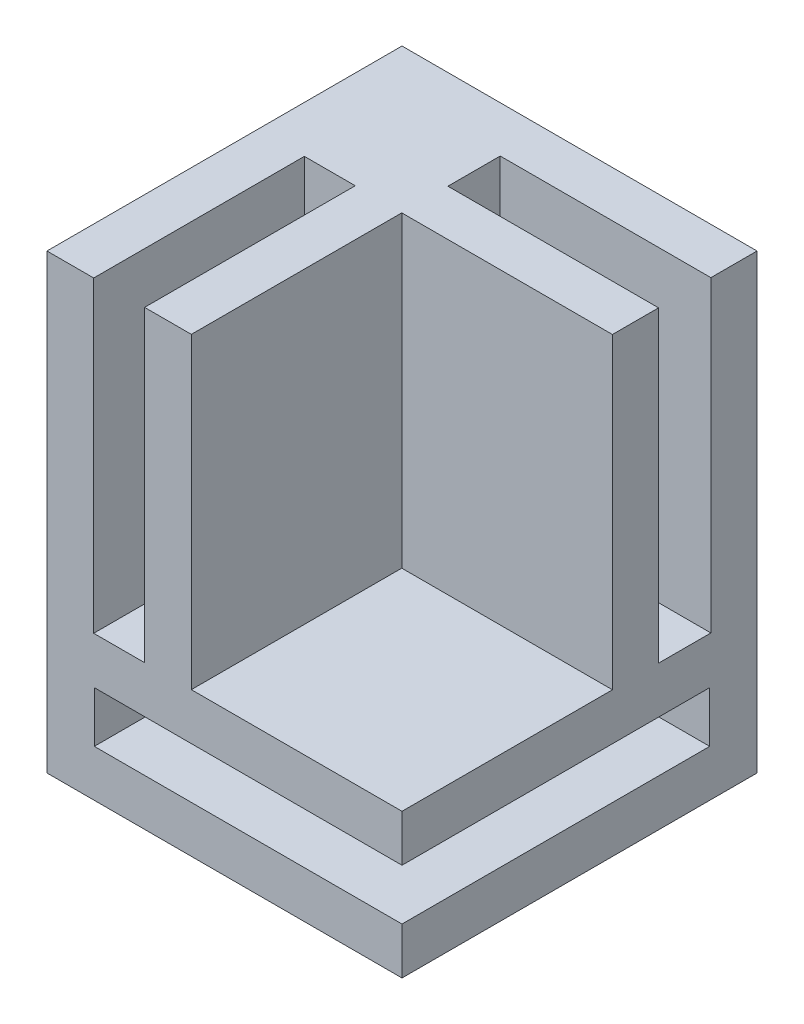
ISO-10303-21;
HEADER;
FILE_DESCRIPTION(('STEP AP214'),'2;1');
FILE_NAME('part.step','',(''),(''),'','','');
FILE_SCHEMA(('AUTOMOTIVE_DESIGN { 1 0 10303 214 1 1 1 1 }'));
ENDSEC;
DATA;
#1=APPLICATION_CONTEXT('core data for automotive mechanical design processes');
#2=APPLICATION_PROTOCOL_DEFINITION('international standard','automotive_design',2000,#1);
#3=PRODUCT_CONTEXT('',#1,'mechanical');
#4=PRODUCT('Part','Part','',(#3));
#5=PRODUCT_RELATED_PRODUCT_CATEGORY('part','',(#4));
#6=PRODUCT_DEFINITION_FORMATION('','',#4);
#7=PRODUCT_DEFINITION_CONTEXT('part definition',#1,'design');
#8=PRODUCT_DEFINITION('design','',#6,#7);
#9=PRODUCT_DEFINITION_SHAPE('','',#8);
#10=(LENGTH_UNIT() NAMED_UNIT(*) SI_UNIT(.MILLI.,.METRE.));
#11=(NAMED_UNIT(*) PLANE_ANGLE_UNIT() SI_UNIT($,.RADIAN.));
#12=(NAMED_UNIT(*) SI_UNIT($,.STERADIAN.) SOLID_ANGLE_UNIT());
#13=UNCERTAINTY_MEASURE_WITH_UNIT(LENGTH_MEASURE(1.E-05),#10,'distance_accuracy_value','');
#14=(GEOMETRIC_REPRESENTATION_CONTEXT(3) GLOBAL_UNCERTAINTY_ASSIGNED_CONTEXT((#13)) GLOBAL_UNIT_ASSIGNED_CONTEXT((#10,
#11,#12)) REPRESENTATION_CONTEXT('',''));
#15=CARTESIAN_POINT('',(0.,0.,0.));
#16=DIRECTION('',(0.,0.,1.));
#17=DIRECTION('',(1.,0.,0.));
#18=AXIS2_PLACEMENT_3D('',#15,#16,#17);
#19=CARTESIAN_POINT('',(-41.2499296580443,24.2977528089888,30.));
#20=DIRECTION('',(1.,0.,0.));
#21=DIRECTION('',(0.,0.,-1.));
#22=AXIS2_PLACEMENT_3D('',#19,#20,#21);
#23=PLANE('',#22);
#24=DIRECTION('',(0.,-1.,0.));
#25=VECTOR('',#24,1.);
#26=CARTESIAN_POINT('',(-41.2499296580443,24.2977528089888,0.));
#27=LINE('',#26,#25);
#28=CARTESIAN_POINT('',(-41.2499296580443,50.2977528089888,0.));
#29=VERTEX_POINT('',#28);
#30=CARTESIAN_POINT('',(-41.2499296580443,12.0977528089888,0.));
#31=VERTEX_POINT('',#30);
#32=EDGE_CURVE('E336',#29,#31,#27,.T.);
#33=ORIENTED_EDGE('',*,*,#32,.T.);
#34=DIRECTION('',(0.,0.,-1.));
#35=VECTOR('',#34,1.);
#36=CARTESIAN_POINT('',(-41.2499296580443,12.0977528089888,30.));
#37=LINE('',#36,#35);
#38=CARTESIAN_POINT('',(-41.2499296580443,12.0977528089888,30.));
#39=VERTEX_POINT('',#38);
#40=EDGE_CURVE('E11',#39,#31,#37,.T.);
#41=ORIENTED_EDGE('',*,*,#40,.F.);
#42=DIRECTION('',(0.,-1.,0.));
#43=VECTOR('',#42,1.);
#44=CARTESIAN_POINT('',(-41.2499296580443,24.2977528089888,30.));
#45=LINE('',#44,#43);
#46=CARTESIAN_POINT('',(-41.2499296580443,50.2977528089888,30.));
#47=VERTEX_POINT('',#46);
#48=EDGE_CURVE('E345',#47,#39,#45,.T.);
#49=ORIENTED_EDGE('',*,*,#48,.F.);
#50=DIRECTION('',(0.,0.,1.));
#51=VECTOR('',#50,1.);
#52=CARTESIAN_POINT('',(-41.2499296580443,50.2977528089888,0.));
#53=LINE('',#52,#51);
#54=EDGE_CURVE('E282',#29,#47,#53,.T.);
#55=ORIENTED_EDGE('',*,*,#54,.F.);
#56=EDGE_LOOP('',(#33,#41,#49,#55));
#57=FACE_BOUND('',#56,.T.);
#58=ADVANCED_FACE('F39',(#57),#23,.F.);
#59=CARTESIAN_POINT('',(-41.2499296580443,12.0977528089888,30.));
#60=DIRECTION('',(0.,1.,0.));
#61=DIRECTION('',(0.,0.,1.));
#62=AXIS2_PLACEMENT_3D('',#59,#60,#61);
#63=PLANE('',#62);
#64=DIRECTION('',(1.,0.,0.));
#65=VECTOR('',#64,1.);
#66=CARTESIAN_POINT('',(-41.2499296580443,12.0977528089888,0.));
#67=LINE('',#66,#65);
#68=CARTESIAN_POINT('',(-11.2499296580443,12.0977528089888,0.));
#69=VERTEX_POINT('',#68);
#70=EDGE_CURVE('E361',#31,#69,#67,.T.);
#71=ORIENTED_EDGE('',*,*,#70,.T.);
#72=DIRECTION('',(0.,0.,-1.));
#73=VECTOR('',#72,1.);
#74=CARTESIAN_POINT('',(-11.2499296580443,12.0977528089888,30.));
#75=LINE('',#74,#73);
#76=CARTESIAN_POINT('',(-11.2499296580443,12.0977528089888,30.));
#77=VERTEX_POINT('',#76);
#78=EDGE_CURVE('E47',#77,#69,#75,.T.);
#79=ORIENTED_EDGE('',*,*,#78,.F.);
#80=DIRECTION('',(1.,0.,0.));
#81=VECTOR('',#80,1.);
#82=CARTESIAN_POINT('',(-41.2499296580443,12.0977528089888,30.));
#83=LINE('',#82,#81);
#84=EDGE_CURVE('E349',#39,#77,#83,.T.);
#85=ORIENTED_EDGE('',*,*,#84,.F.);
#86=ORIENTED_EDGE('',*,*,#40,.T.);
#87=EDGE_LOOP('',(#71,#79,#85,#86));
#88=FACE_BOUND('',#87,.T.);
#89=ADVANCED_FACE('F434',(#88),#63,.F.);
#90=CARTESIAN_POINT('',(-11.2499296580443,24.2977528089888,30.));
#91=DIRECTION('',(-1.,0.,0.));
#92=DIRECTION('',(0.,0.,1.));
#93=AXIS2_PLACEMENT_3D('',#90,#91,#92);
#94=PLANE('',#93);
#95=DIRECTION('',(0.,0.,-1.));
#96=VECTOR('',#95,1.);
#97=CARTESIAN_POINT('',(-11.2499296580443,24.2977528089888,8.32));
#98=LINE('',#97,#96);
#99=CARTESIAN_POINT('',(-11.2499296580443,24.2977528089888,8.32));
#100=VERTEX_POINT('',#99);
#101=CARTESIAN_POINT('',(-11.2499296580443,24.2977528089888,3.9));
#102=VERTEX_POINT('',#101);
#103=EDGE_CURVE('E236',#100,#102,#98,.T.);
#104=ORIENTED_EDGE('',*,*,#103,.F.);
#105=DIRECTION('',(0.,-1.,0.));
#106=VECTOR('',#105,1.);
#107=CARTESIAN_POINT('',(-11.2499296580443,50.2977528089888,8.32));
#108=LINE('',#107,#106);
#109=CARTESIAN_POINT('',(-11.2499296580443,50.2977528089888,8.32));
#110=VERTEX_POINT('',#109);
#111=EDGE_CURVE('E212',#110,#100,#108,.T.);
#112=ORIENTED_EDGE('',*,*,#111,.F.);
#113=DIRECTION('',(0.,0.,-1.));
#114=VECTOR('',#113,1.);
#115=CARTESIAN_POINT('',(-11.2499296580443,50.2977528089888,0.));
#116=LINE('',#115,#114);
#117=CARTESIAN_POINT('',(-11.2499296580443,50.2977528089888,12.22));
#118=VERTEX_POINT('',#117);
#119=EDGE_CURVE('E297',#118,#110,#116,.T.);
#120=ORIENTED_EDGE('',*,*,#119,.F.);
#121=DIRECTION('',(0.,1.,0.));
#122=VECTOR('',#121,1.);
#123=CARTESIAN_POINT('',(-11.2499296580443,24.2977528089888,12.22));
#124=LINE('',#123,#122);
#125=CARTESIAN_POINT('',(-11.2499296580443,24.2977528089888,12.22));
#126=VERTEX_POINT('',#125);
#127=EDGE_CURVE('E271',#126,#118,#124,.T.);
#128=ORIENTED_EDGE('',*,*,#127,.F.);
#129=DIRECTION('',(0.,0.,-1.));
#130=VECTOR('',#129,1.);
#131=CARTESIAN_POINT('',(-11.2499296580443,24.2977528089888,30.));
#132=LINE('',#131,#130);
#133=CARTESIAN_POINT('',(-11.2499296580443,24.2977528089888,30.));
#134=VERTEX_POINT('',#133);
#135=EDGE_CURVE('E255',#134,#126,#132,.T.);
#136=ORIENTED_EDGE('',*,*,#135,.F.);
#137=DIRECTION('',(0.,1.,0.));
#138=VECTOR('',#137,1.);
#139=CARTESIAN_POINT('',(-11.2499296580443,24.2977528089888,30.));
#140=LINE('',#139,#138);
#141=CARTESIAN_POINT('',(-11.2499296580443,20.3477528089888,30.));
#142=VERTEX_POINT('',#141);
#143=EDGE_CURVE('E353',#142,#134,#140,.T.);
#144=ORIENTED_EDGE('',*,*,#143,.F.);
#145=DIRECTION('',(0.,0.,1.));
#146=VECTOR('',#145,1.);
#147=CARTESIAN_POINT('',(-11.2499296580443,20.3477528089888,30.));
#148=LINE('',#147,#146);
#149=CARTESIAN_POINT('',(-11.2499296580443,20.3477528089888,4.));
#150=VERTEX_POINT('',#149);
#151=EDGE_CURVE('E311',#150,#142,#148,.T.);
#152=ORIENTED_EDGE('',*,*,#151,.F.);
#153=DIRECTION('',(0.,1.,0.));
#154=VECTOR('',#153,1.);
#155=CARTESIAN_POINT('',(-11.2499296580443,20.3477528089888,4.));
#156=LINE('',#155,#154);
#157=CARTESIAN_POINT('',(-11.2499296580443,16.0477528089888,4.));
#158=VERTEX_POINT('',#157);
#159=EDGE_CURVE('E326',#158,#150,#156,.T.);
#160=ORIENTED_EDGE('',*,*,#159,.F.);
#161=DIRECTION('',(0.,0.,-1.));
#162=VECTOR('',#161,1.);
#163=CARTESIAN_POINT('',(-11.2499296580443,16.0477528089888,30.));
#164=LINE('',#163,#162);
#165=CARTESIAN_POINT('',(-11.2499296580443,16.0477528089888,30.));
#166=VERTEX_POINT('',#165);
#167=EDGE_CURVE('E305',#166,#158,#164,.T.);
#168=ORIENTED_EDGE('',*,*,#167,.F.);
#169=EDGE_CURVE('E354',#77,#166,#140,.T.);
#170=ORIENTED_EDGE('',*,*,#169,.F.);
#171=ORIENTED_EDGE('',*,*,#78,.T.);
#172=DIRECTION('',(0.,1.,0.));
#173=VECTOR('',#172,1.);
#174=CARTESIAN_POINT('',(-11.2499296580443,24.2977528089888,0.));
#175=LINE('',#174,#173);
#176=CARTESIAN_POINT('',(-11.2499296580443,50.2977528089888,0.));
#177=VERTEX_POINT('',#176);
#178=EDGE_CURVE('E350',#69,#177,#175,.T.);
#179=ORIENTED_EDGE('',*,*,#178,.T.);
#180=CARTESIAN_POINT('',(-11.2499296580443,50.2977528089888,3.9));
#181=VERTEX_POINT('',#180);
#182=EDGE_CURVE('E296',#181,#177,#116,.T.);
#183=ORIENTED_EDGE('',*,*,#182,.F.);
#184=DIRECTION('',(0.,1.,0.));
#185=VECTOR('',#184,1.);
#186=CARTESIAN_POINT('',(-11.2499296580443,50.2977528089888,3.9));
#187=LINE('',#186,#185);
#188=EDGE_CURVE('E224',#102,#181,#187,.T.);
#189=ORIENTED_EDGE('',*,*,#188,.F.);
#190=EDGE_LOOP('',(#104,#112,#120,#128,#136,#144,#152,#160,#168,#170,#171,#179,#183,#189));
#191=FACE_BOUND('',#190,.T.);
#192=ADVANCED_FACE('F373',(#191),#94,.F.);
#193=CARTESIAN_POINT('',(0.,0.,30.));
#194=DIRECTION('',(0.,0.,1.));
#195=DIRECTION('',(1.,0.,0.));
#196=AXIS2_PLACEMENT_3D('',#193,#194,#195);
#197=PLANE('',#196);
#198=DIRECTION('',(0.,-1.,0.));
#199=VECTOR('',#198,1.);
#200=CARTESIAN_POINT('',(-37.2999296580443,50.2977528089888,30.));
#201=LINE('',#200,#199);
#202=CARTESIAN_POINT('',(-37.2999296580443,50.2977528089888,30.));
#203=VERTEX_POINT('',#202);
#204=CARTESIAN_POINT('',(-37.2999296580443,24.2977528089888,30.));
#205=VERTEX_POINT('',#204);
#206=EDGE_CURVE('E179',#203,#205,#201,.T.);
#207=ORIENTED_EDGE('',*,*,#206,.F.);
#208=DIRECTION('',(1.,0.,0.));
#209=VECTOR('',#208,1.);
#210=CARTESIAN_POINT('',(-41.2499296580443,50.2977528089888,30.));
#211=LINE('',#210,#209);
#212=EDGE_CURVE('E292',#47,#203,#211,.T.);
#213=ORIENTED_EDGE('',*,*,#212,.F.);
#214=ORIENTED_EDGE('',*,*,#48,.T.);
#215=ORIENTED_EDGE('',*,*,#84,.T.);
#216=ORIENTED_EDGE('',*,*,#169,.T.);
#217=DIRECTION('',(1.,0.,0.));
#218=VECTOR('',#217,1.);
#219=CARTESIAN_POINT('',(-37.2499296580443,16.0477528089888,30.));
#220=LINE('',#219,#218);
#221=CARTESIAN_POINT('',(-37.2499296580443,16.0477528089888,30.));
#222=VERTEX_POINT('',#221);
#223=EDGE_CURVE('E322',#222,#166,#220,.T.);
#224=ORIENTED_EDGE('',*,*,#223,.F.);
#225=DIRECTION('',(0.,-1.,0.));
#226=VECTOR('',#225,1.);
#227=CARTESIAN_POINT('',(-37.2499296580443,20.3477528089888,30.));
#228=LINE('',#227,#226);
#229=CARTESIAN_POINT('',(-37.2499296580443,20.3477528089888,30.));
#230=VERTEX_POINT('',#229);
#231=EDGE_CURVE('E306',#230,#222,#228,.T.);
#232=ORIENTED_EDGE('',*,*,#231,.F.);
#233=DIRECTION('',(1.,0.,0.));
#234=VECTOR('',#233,1.);
#235=CARTESIAN_POINT('',(-37.2499296580443,20.3477528089888,30.));
#236=LINE('',#235,#234);
#237=EDGE_CURVE('E332',#230,#142,#236,.T.);
#238=ORIENTED_EDGE('',*,*,#237,.T.);
#239=ORIENTED_EDGE('',*,*,#143,.T.);
#240=DIRECTION('',(1.,0.,0.));
#241=VECTOR('',#240,1.);
#242=CARTESIAN_POINT('',(-11.2499296580443,24.2977528089888,30.));
#243=LINE('',#242,#241);
#244=CARTESIAN_POINT('',(-29.0499296580443,24.2977528089888,30.));
#245=VERTEX_POINT('',#244);
#246=EDGE_CURVE('E268',#245,#134,#243,.T.);
#247=ORIENTED_EDGE('',*,*,#246,.F.);
#248=DIRECTION('',(0.,1.,0.));
#249=VECTOR('',#248,1.);
#250=CARTESIAN_POINT('',(-29.0499296580443,24.2977528089888,30.));
#251=LINE('',#250,#249);
#252=CARTESIAN_POINT('',(-29.0499296580443,50.2977528089888,30.));
#253=VERTEX_POINT('',#252);
#254=EDGE_CURVE('E278',#245,#253,#251,.T.);
#255=ORIENTED_EDGE('',*,*,#254,.T.);
#256=CARTESIAN_POINT('',(-32.9999296580443,50.2977528089888,30.));
#257=VERTEX_POINT('',#256);
#258=EDGE_CURVE('E291',#257,#253,#211,.T.);
#259=ORIENTED_EDGE('',*,*,#258,.F.);
#260=DIRECTION('',(0.,1.,0.));
#261=VECTOR('',#260,1.);
#262=CARTESIAN_POINT('',(-32.9999296580443,50.2977528089888,30.));
#263=LINE('',#262,#261);
#264=CARTESIAN_POINT('',(-32.9999296580443,24.2977528089888,30.));
#265=VERTEX_POINT('',#264);
#266=EDGE_CURVE('E195',#265,#257,#263,.T.);
#267=ORIENTED_EDGE('',*,*,#266,.F.);
#268=DIRECTION('',(1.,0.,0.));
#269=VECTOR('',#268,1.);
#270=CARTESIAN_POINT('',(-37.2999296580443,24.2977528089888,30.));
#271=LINE('',#270,#269);
#272=EDGE_CURVE('E198',#205,#265,#271,.T.);
#273=ORIENTED_EDGE('',*,*,#272,.F.);
#274=EDGE_LOOP('',(#207,#213,#214,#215,#216,#224,#232,#238,#239,#247,#255,#259,#267,#273));
#275=FACE_BOUND('',#274,.T.);
#276=ADVANCED_FACE('F387',(#275),#197,.T.);
#277=CARTESIAN_POINT('',(0.,0.,0.));
#278=DIRECTION('',(0.,0.,1.));
#279=DIRECTION('',(1.,0.,0.));
#280=AXIS2_PLACEMENT_3D('',#277,#278,#279);
#281=PLANE('',#280);
#282=ORIENTED_EDGE('',*,*,#32,.F.);
#283=DIRECTION('',(-1.,0.,0.));
#284=VECTOR('',#283,1.);
#285=CARTESIAN_POINT('',(-41.2499296580443,50.2977528089888,0.));
#286=LINE('',#285,#284);
#287=EDGE_CURVE('E301',#177,#29,#286,.T.);
#288=ORIENTED_EDGE('',*,*,#287,.F.);
#289=ORIENTED_EDGE('',*,*,#178,.F.);
#290=ORIENTED_EDGE('',*,*,#70,.F.);
#291=EDGE_LOOP('',(#282,#288,#289,#290));
#292=FACE_BOUND('',#291,.T.);
#293=ADVANCED_FACE('F379',(#292),#281,.F.);
#294=CARTESIAN_POINT('',(-37.2499296580443,20.3477528089888,30.));
#295=DIRECTION('',(0.,1.,0.));
#296=DIRECTION('',(0.,0.,1.));
#297=AXIS2_PLACEMENT_3D('',#294,#295,#296);
#298=PLANE('',#297);
#299=ORIENTED_EDGE('',*,*,#151,.T.);
#300=ORIENTED_EDGE('',*,*,#237,.F.);
#301=DIRECTION('',(0.,0.,1.));
#302=VECTOR('',#301,1.);
#303=CARTESIAN_POINT('',(-37.2499296580443,20.3477528089888,30.));
#304=LINE('',#303,#302);
#305=CARTESIAN_POINT('',(-37.2499296580443,20.3477528089888,4.));
#306=VERTEX_POINT('',#305);
#307=EDGE_CURVE('E319',#306,#230,#304,.T.);
#308=ORIENTED_EDGE('',*,*,#307,.F.);
#309=DIRECTION('',(1.,0.,0.));
#310=VECTOR('',#309,1.);
#311=CARTESIAN_POINT('',(-37.2499296580443,20.3477528089888,4.));
#312=LINE('',#311,#310);
#313=EDGE_CURVE('E337',#306,#150,#312,.T.);
#314=ORIENTED_EDGE('',*,*,#313,.T.);
#315=EDGE_LOOP('',(#299,#300,#308,#314));
#316=FACE_BOUND('',#315,.T.);
#317=ADVANCED_FACE('F445',(#316),#298,.F.);
#318=CARTESIAN_POINT('',(-37.2499296580443,20.3477528089888,4.));
#319=DIRECTION('',(0.,0.,-1.));
#320=DIRECTION('',(-1.,0.,0.));
#321=AXIS2_PLACEMENT_3D('',#318,#319,#320);
#322=PLANE('',#321);
#323=ORIENTED_EDGE('',*,*,#159,.T.);
#324=ORIENTED_EDGE('',*,*,#313,.F.);
#325=DIRECTION('',(0.,1.,0.));
#326=VECTOR('',#325,1.);
#327=CARTESIAN_POINT('',(-37.2499296580443,20.3477528089888,4.));
#328=LINE('',#327,#326);
#329=CARTESIAN_POINT('',(-37.2499296580443,16.0477528089888,4.));
#330=VERTEX_POINT('',#329);
#331=EDGE_CURVE('E315',#330,#306,#328,.T.);
#332=ORIENTED_EDGE('',*,*,#331,.F.);
#333=DIRECTION('',(1.,0.,0.));
#334=VECTOR('',#333,1.);
#335=CARTESIAN_POINT('',(-37.2499296580443,16.0477528089888,4.));
#336=LINE('',#335,#334);
#337=EDGE_CURVE('E340',#330,#158,#336,.T.);
#338=ORIENTED_EDGE('',*,*,#337,.T.);
#339=EDGE_LOOP('',(#323,#324,#332,#338));
#340=FACE_BOUND('',#339,.T.);
#341=ADVANCED_FACE('F452',(#340),#322,.F.);
#342=CARTESIAN_POINT('',(-37.2499296580443,16.0477528089888,30.));
#343=DIRECTION('',(0.,-1.,0.));
#344=DIRECTION('',(0.,0.,-1.));
#345=AXIS2_PLACEMENT_3D('',#342,#343,#344);
#346=PLANE('',#345);
#347=ORIENTED_EDGE('',*,*,#167,.T.);
#348=ORIENTED_EDGE('',*,*,#337,.F.);
#349=DIRECTION('',(0.,0.,-1.));
#350=VECTOR('',#349,1.);
#351=CARTESIAN_POINT('',(-37.2499296580443,16.0477528089888,30.));
#352=LINE('',#351,#350);
#353=EDGE_CURVE('E310',#222,#330,#352,.T.);
#354=ORIENTED_EDGE('',*,*,#353,.F.);
#355=ORIENTED_EDGE('',*,*,#223,.T.);
#356=EDGE_LOOP('',(#347,#348,#354,#355));
#357=FACE_BOUND('',#356,.T.);
#358=ADVANCED_FACE('F448',(#357),#346,.F.);
#359=CARTESIAN_POINT('',(-37.2499296580443,0.,0.));
#360=DIRECTION('',(1.,0.,0.));
#361=DIRECTION('',(0.,0.,-1.));
#362=AXIS2_PLACEMENT_3D('',#359,#360,#361);
#363=PLANE('',#362);
#364=ORIENTED_EDGE('',*,*,#231,.T.);
#365=ORIENTED_EDGE('',*,*,#353,.T.);
#366=ORIENTED_EDGE('',*,*,#331,.T.);
#367=ORIENTED_EDGE('',*,*,#307,.T.);
#368=EDGE_LOOP('',(#364,#365,#366,#367));
#369=FACE_BOUND('',#368,.T.);
#370=ADVANCED_FACE('F451',(#369),#363,.T.);
#371=CARTESIAN_POINT('',(0.,50.2977528089888,0.));
#372=DIRECTION('',(0.,1.,0.));
#373=DIRECTION('',(0.,0.,1.));
#374=AXIS2_PLACEMENT_3D('',#371,#372,#373);
#375=PLANE('',#374);
#376=DIRECTION('',(0.,0.,1.));
#377=VECTOR('',#376,1.);
#378=CARTESIAN_POINT('',(-37.2999296580443,50.2977528089888,12.2));
#379=LINE('',#378,#377);
#380=CARTESIAN_POINT('',(-37.2999296580443,50.2977528089888,12.2));
#381=VERTEX_POINT('',#380);
#382=EDGE_CURVE('E209',#381,#203,#379,.T.);
#383=ORIENTED_EDGE('',*,*,#382,.F.);
#384=DIRECTION('',(-1.,0.,0.));
#385=VECTOR('',#384,1.);
#386=CARTESIAN_POINT('',(-37.2999296580443,50.2977528089888,12.2));
#387=LINE('',#386,#385);
#388=CARTESIAN_POINT('',(-32.9999296580443,50.2977528089888,12.2));
#389=VERTEX_POINT('',#388);
#390=EDGE_CURVE('E185',#389,#381,#387,.T.);
#391=ORIENTED_EDGE('',*,*,#390,.F.);
#392=DIRECTION('',(0.,0.,1.));
#393=VECTOR('',#392,1.);
#394=CARTESIAN_POINT('',(-32.9999296580443,50.2977528089888,12.2));
#395=LINE('',#394,#393);
#396=EDGE_CURVE('E213',#389,#257,#395,.T.);
#397=ORIENTED_EDGE('',*,*,#396,.T.);
#398=ORIENTED_EDGE('',*,*,#258,.T.);
#399=DIRECTION('',(0.,0.,1.));
#400=VECTOR('',#399,1.);
#401=CARTESIAN_POINT('',(-29.0499296580443,50.2977528089888,30.));
#402=LINE('',#401,#400);
#403=CARTESIAN_POINT('',(-29.0499296580443,50.2977528089888,12.22));
#404=VERTEX_POINT('',#403);
#405=EDGE_CURVE('E260',#404,#253,#402,.T.);
#406=ORIENTED_EDGE('',*,*,#405,.F.);
#407=DIRECTION('',(-1.,0.,0.));
#408=VECTOR('',#407,1.);
#409=CARTESIAN_POINT('',(-11.2499296580443,50.2977528089888,12.22));
#410=LINE('',#409,#408);
#411=EDGE_CURVE('E245',#118,#404,#410,.T.);
#412=ORIENTED_EDGE('',*,*,#411,.F.);
#413=ORIENTED_EDGE('',*,*,#119,.T.);
#414=DIRECTION('',(1.,0.,0.));
#415=VECTOR('',#414,1.);
#416=CARTESIAN_POINT('',(-29.0499296580443,50.2977528089888,8.32));
#417=LINE('',#416,#415);
#418=CARTESIAN_POINT('',(-29.0499296580443,50.2977528089888,8.32));
#419=VERTEX_POINT('',#418);
#420=EDGE_CURVE('E242',#419,#110,#417,.T.);
#421=ORIENTED_EDGE('',*,*,#420,.F.);
#422=DIRECTION('',(0.,0.,1.));
#423=VECTOR('',#422,1.);
#424=CARTESIAN_POINT('',(-29.0499296580443,50.2977528089888,8.32));
#425=LINE('',#424,#423);
#426=CARTESIAN_POINT('',(-29.0499296580443,50.2977528089888,3.9));
#427=VERTEX_POINT('',#426);
#428=EDGE_CURVE('E229',#427,#419,#425,.T.);
#429=ORIENTED_EDGE('',*,*,#428,.F.);
#430=DIRECTION('',(1.,0.,0.));
#431=VECTOR('',#430,1.);
#432=CARTESIAN_POINT('',(-29.0499296580443,50.2977528089888,3.9));
#433=LINE('',#432,#431);
#434=EDGE_CURVE('E246',#427,#181,#433,.T.);
#435=ORIENTED_EDGE('',*,*,#434,.T.);
#436=ORIENTED_EDGE('',*,*,#182,.T.);
#437=ORIENTED_EDGE('',*,*,#287,.T.);
#438=ORIENTED_EDGE('',*,*,#54,.T.);
#439=ORIENTED_EDGE('',*,*,#212,.T.);
#440=EDGE_LOOP('',(#383,#391,#397,#398,#406,#412,#413,#421,#429,#435,#436,#437,#438,#439));
#441=FACE_BOUND('',#440,.T.);
#442=ADVANCED_FACE('F382',(#441),#375,.T.);
#443=CARTESIAN_POINT('',(-29.0499296580443,24.2977528089888,30.));
#444=DIRECTION('',(-1.,0.,0.));
#445=DIRECTION('',(0.,0.,1.));
#446=AXIS2_PLACEMENT_3D('',#443,#444,#445);
#447=PLANE('',#446);
#448=ORIENTED_EDGE('',*,*,#405,.T.);
#449=ORIENTED_EDGE('',*,*,#254,.F.);
#450=DIRECTION('',(0.,0.,1.));
#451=VECTOR('',#450,1.);
#452=CARTESIAN_POINT('',(-29.0499296580443,24.2977528089888,30.));
#453=LINE('',#452,#451);
#454=CARTESIAN_POINT('',(-29.0499296580443,24.2977528089888,12.22));
#455=VERTEX_POINT('',#454);
#456=EDGE_CURVE('E264',#455,#245,#453,.T.);
#457=ORIENTED_EDGE('',*,*,#456,.F.);
#458=DIRECTION('',(0.,1.,0.));
#459=VECTOR('',#458,1.);
#460=CARTESIAN_POINT('',(-29.0499296580443,24.2977528089888,12.22));
#461=LINE('',#460,#459);
#462=EDGE_CURVE('E283',#455,#404,#461,.T.);
#463=ORIENTED_EDGE('',*,*,#462,.T.);
#464=EDGE_LOOP('',(#448,#449,#457,#463));
#465=FACE_BOUND('',#464,.T.);
#466=ADVANCED_FACE('F409',(#465),#447,.F.);
#467=CARTESIAN_POINT('',(-11.2499296580443,24.2977528089888,12.22));
#468=DIRECTION('',(0.,0.,-1.));
#469=DIRECTION('',(-1.,0.,0.));
#470=AXIS2_PLACEMENT_3D('',#467,#468,#469);
#471=PLANE('',#470);
#472=ORIENTED_EDGE('',*,*,#411,.T.);
#473=ORIENTED_EDGE('',*,*,#462,.F.);
#474=DIRECTION('',(-1.,0.,0.));
#475=VECTOR('',#474,1.);
#476=CARTESIAN_POINT('',(-11.2499296580443,24.2977528089888,12.22));
#477=LINE('',#476,#475);
#478=EDGE_CURVE('E259',#126,#455,#477,.T.);
#479=ORIENTED_EDGE('',*,*,#478,.F.);
#480=ORIENTED_EDGE('',*,*,#127,.T.);
#481=EDGE_LOOP('',(#472,#473,#479,#480));
#482=FACE_BOUND('',#481,.T.);
#483=ADVANCED_FACE('F465',(#482),#471,.F.);
#484=CARTESIAN_POINT('',(0.,24.2977528089888,0.));
#485=DIRECTION('',(0.,1.,0.));
#486=DIRECTION('',(0.,0.,1.));
#487=AXIS2_PLACEMENT_3D('',#484,#485,#486);
#488=PLANE('',#487);
#489=ORIENTED_EDGE('',*,*,#135,.T.);
#490=ORIENTED_EDGE('',*,*,#478,.T.);
#491=ORIENTED_EDGE('',*,*,#456,.T.);
#492=ORIENTED_EDGE('',*,*,#246,.T.);
#493=EDGE_LOOP('',(#489,#490,#491,#492));
#494=FACE_BOUND('',#493,.T.);
#495=ADVANCED_FACE('F406',(#494),#488,.T.);
#496=CARTESIAN_POINT('',(-29.0499296580443,50.2977528089888,8.32));
#497=DIRECTION('',(0.,0.,1.));
#498=DIRECTION('',(0.,-1.,0.));
#499=AXIS2_PLACEMENT_3D('',#496,#497,#498);
#500=PLANE('',#499);
#501=ORIENTED_EDGE('',*,*,#111,.T.);
#502=DIRECTION('',(1.,0.,0.));
#503=VECTOR('',#502,1.);
#504=CARTESIAN_POINT('',(-29.0499296580443,24.2977528089888,8.32));
#505=LINE('',#504,#503);
#506=CARTESIAN_POINT('',(-29.0499296580443,24.2977528089888,8.32));
#507=VERTEX_POINT('',#506);
#508=EDGE_CURVE('E232',#507,#100,#505,.T.);
#509=ORIENTED_EDGE('',*,*,#508,.F.);
#510=DIRECTION('',(0.,-1.,0.));
#511=VECTOR('',#510,1.);
#512=CARTESIAN_POINT('',(-29.0499296580443,50.2977528089888,8.32));
#513=LINE('',#512,#511);
#514=EDGE_CURVE('E219',#419,#507,#513,.T.);
#515=ORIENTED_EDGE('',*,*,#514,.F.);
#516=ORIENTED_EDGE('',*,*,#420,.T.);
#517=EDGE_LOOP('',(#501,#509,#515,#516));
#518=FACE_BOUND('',#517,.T.);
#519=ADVANCED_FACE('F416',(#518),#500,.F.);
#520=CARTESIAN_POINT('',(-29.0499296580443,50.2977528089888,3.9));
#521=DIRECTION('',(0.,0.,-1.));
#522=DIRECTION('',(0.,1.,0.));
#523=AXIS2_PLACEMENT_3D('',#520,#521,#522);
#524=PLANE('',#523);
#525=ORIENTED_EDGE('',*,*,#188,.T.);
#526=ORIENTED_EDGE('',*,*,#434,.F.);
#527=DIRECTION('',(0.,1.,0.));
#528=VECTOR('',#527,1.);
#529=CARTESIAN_POINT('',(-29.0499296580443,50.2977528089888,3.9));
#530=LINE('',#529,#528);
#531=CARTESIAN_POINT('',(-29.0499296580443,24.2977528089888,3.9));
#532=VERTEX_POINT('',#531);
#533=EDGE_CURVE('E62',#532,#427,#530,.T.);
#534=ORIENTED_EDGE('',*,*,#533,.F.);
#535=DIRECTION('',(1.,0.,0.));
#536=VECTOR('',#535,1.);
#537=CARTESIAN_POINT('',(-29.0499296580443,24.2977528089888,3.9));
#538=LINE('',#537,#536);
#539=EDGE_CURVE('E250',#532,#102,#538,.T.);
#540=ORIENTED_EDGE('',*,*,#539,.T.);
#541=EDGE_LOOP('',(#525,#526,#534,#540));
#542=FACE_BOUND('',#541,.T.);
#543=ADVANCED_FACE('F423',(#542),#524,.F.);
#544=CARTESIAN_POINT('',(-29.0499296580443,24.2977528089888,8.32));
#545=DIRECTION('',(0.,-1.,0.));
#546=DIRECTION('',(0.,0.,-1.));
#547=AXIS2_PLACEMENT_3D('',#544,#545,#546);
#548=PLANE('',#547);
#549=ORIENTED_EDGE('',*,*,#103,.T.);
#550=ORIENTED_EDGE('',*,*,#539,.F.);
#551=DIRECTION('',(0.,0.,-1.));
#552=VECTOR('',#551,1.);
#553=CARTESIAN_POINT('',(-29.0499296580443,24.2977528089888,8.32));
#554=LINE('',#553,#552);
#555=EDGE_CURVE('E223',#507,#532,#554,.T.);
#556=ORIENTED_EDGE('',*,*,#555,.F.);
#557=ORIENTED_EDGE('',*,*,#508,.T.);
#558=EDGE_LOOP('',(#549,#550,#556,#557));
#559=FACE_BOUND('',#558,.T.);
#560=ADVANCED_FACE('F421',(#559),#548,.F.);
#561=CARTESIAN_POINT('',(-29.0499296580443,0.,0.));
#562=DIRECTION('',(1.,0.,0.));
#563=DIRECTION('',(0.,0.,-1.));
#564=AXIS2_PLACEMENT_3D('',#561,#562,#563);
#565=PLANE('',#564);
#566=ORIENTED_EDGE('',*,*,#514,.T.);
#567=ORIENTED_EDGE('',*,*,#555,.T.);
#568=ORIENTED_EDGE('',*,*,#533,.T.);
#569=ORIENTED_EDGE('',*,*,#428,.T.);
#570=EDGE_LOOP('',(#566,#567,#568,#569));
#571=FACE_BOUND('',#570,.T.);
#572=ADVANCED_FACE('F419',(#571),#565,.T.);
#573=CARTESIAN_POINT('',(-37.2999296580443,50.2977528089888,12.2));
#574=DIRECTION('',(-1.,0.,0.));
#575=DIRECTION('',(0.,0.,1.));
#576=AXIS2_PLACEMENT_3D('',#573,#574,#575);
#577=PLANE('',#576);
#578=ORIENTED_EDGE('',*,*,#206,.T.);
#579=DIRECTION('',(0.,0.,1.));
#580=VECTOR('',#579,1.);
#581=CARTESIAN_POINT('',(-37.2999296580443,24.2977528089888,12.2));
#582=LINE('',#581,#580);
#583=CARTESIAN_POINT('',(-37.2999296580443,24.2977528089888,12.2));
#584=VERTEX_POINT('',#583);
#585=EDGE_CURVE('E173',#584,#205,#582,.T.);
#586=ORIENTED_EDGE('',*,*,#585,.F.);
#587=DIRECTION('',(0.,-1.,0.));
#588=VECTOR('',#587,1.);
#589=CARTESIAN_POINT('',(-37.2999296580443,50.2977528089888,12.2));
#590=LINE('',#589,#588);
#591=EDGE_CURVE('E177',#381,#584,#590,.T.);
#592=ORIENTED_EDGE('',*,*,#591,.F.);
#593=ORIENTED_EDGE('',*,*,#382,.T.);
#594=EDGE_LOOP('',(#578,#586,#592,#593));
#595=FACE_BOUND('',#594,.T.);
#596=ADVANCED_FACE('F175',(#595),#577,.F.);
#597=CARTESIAN_POINT('',(-32.9999296580443,50.2977528089888,12.2));
#598=DIRECTION('',(1.,0.,0.));
#599=DIRECTION('',(0.,1.,0.));
#600=AXIS2_PLACEMENT_3D('',#597,#598,#599);
#601=PLANE('',#600);
#602=ORIENTED_EDGE('',*,*,#266,.T.);
#603=ORIENTED_EDGE('',*,*,#396,.F.);
#604=DIRECTION('',(0.,1.,0.));
#605=VECTOR('',#604,1.);
#606=CARTESIAN_POINT('',(-32.9999296580443,50.2977528089888,12.2));
#607=LINE('',#606,#605);
#608=CARTESIAN_POINT('',(-32.9999296580443,24.2977528089888,12.2));
#609=VERTEX_POINT('',#608);
#610=EDGE_CURVE('E54',#609,#389,#607,.T.);
#611=ORIENTED_EDGE('',*,*,#610,.F.);
#612=DIRECTION('',(0.,0.,1.));
#613=VECTOR('',#612,1.);
#614=CARTESIAN_POINT('',(-32.9999296580443,24.2977528089888,12.2));
#615=LINE('',#614,#613);
#616=EDGE_CURVE('E184',#609,#265,#615,.T.);
#617=ORIENTED_EDGE('',*,*,#616,.T.);
#618=EDGE_LOOP('',(#602,#603,#611,#617));
#619=FACE_BOUND('',#618,.T.);
#620=ADVANCED_FACE('F523',(#619),#601,.F.);
#621=CARTESIAN_POINT('',(-37.2999296580443,24.2977528089888,12.2));
#622=DIRECTION('',(0.,-1.,0.));
#623=DIRECTION('',(1.,0.,0.));
#624=AXIS2_PLACEMENT_3D('',#621,#622,#623);
#625=PLANE('',#624);
#626=ORIENTED_EDGE('',*,*,#272,.T.);
#627=ORIENTED_EDGE('',*,*,#616,.F.);
#628=DIRECTION('',(1.,0.,0.));
#629=VECTOR('',#628,1.);
#630=CARTESIAN_POINT('',(-37.2999296580443,24.2977528089888,12.2));
#631=LINE('',#630,#629);
#632=EDGE_CURVE('E187',#584,#609,#631,.T.);
#633=ORIENTED_EDGE('',*,*,#632,.F.);
#634=ORIENTED_EDGE('',*,*,#585,.T.);
#635=EDGE_LOOP('',(#626,#627,#633,#634));
#636=FACE_BOUND('',#635,.T.);
#637=ADVANCED_FACE('F188',(#636),#625,.F.);
#638=CARTESIAN_POINT('',(0.,0.,12.2));
#639=DIRECTION('',(0.,0.,1.));
#640=DIRECTION('',(1.,0.,0.));
#641=AXIS2_PLACEMENT_3D('',#638,#639,#640);
#642=PLANE('',#641);
#643=ORIENTED_EDGE('',*,*,#591,.T.);
#644=ORIENTED_EDGE('',*,*,#632,.T.);
#645=ORIENTED_EDGE('',*,*,#610,.T.);
#646=ORIENTED_EDGE('',*,*,#390,.T.);
#647=EDGE_LOOP('',(#643,#644,#645,#646));
#648=FACE_BOUND('',#647,.T.);
#649=ADVANCED_FACE('F191',(#648),#642,.T.);
#650=CLOSED_SHELL('',(#58,#89,#192,#276,#293,#317,#341,#358,#370,#442,#466,#483,#495,#519,#543,
#560,#572,#596,#620,#637,#649));
#651=MANIFOLD_SOLID_BREP('B2',#650);
#652=ADVANCED_BREP_SHAPE_REPRESENTATION('',(#18,#651),#14);
#653=SHAPE_DEFINITION_REPRESENTATION(#9,#652);
ENDSEC;
END-ISO-10303-21;
